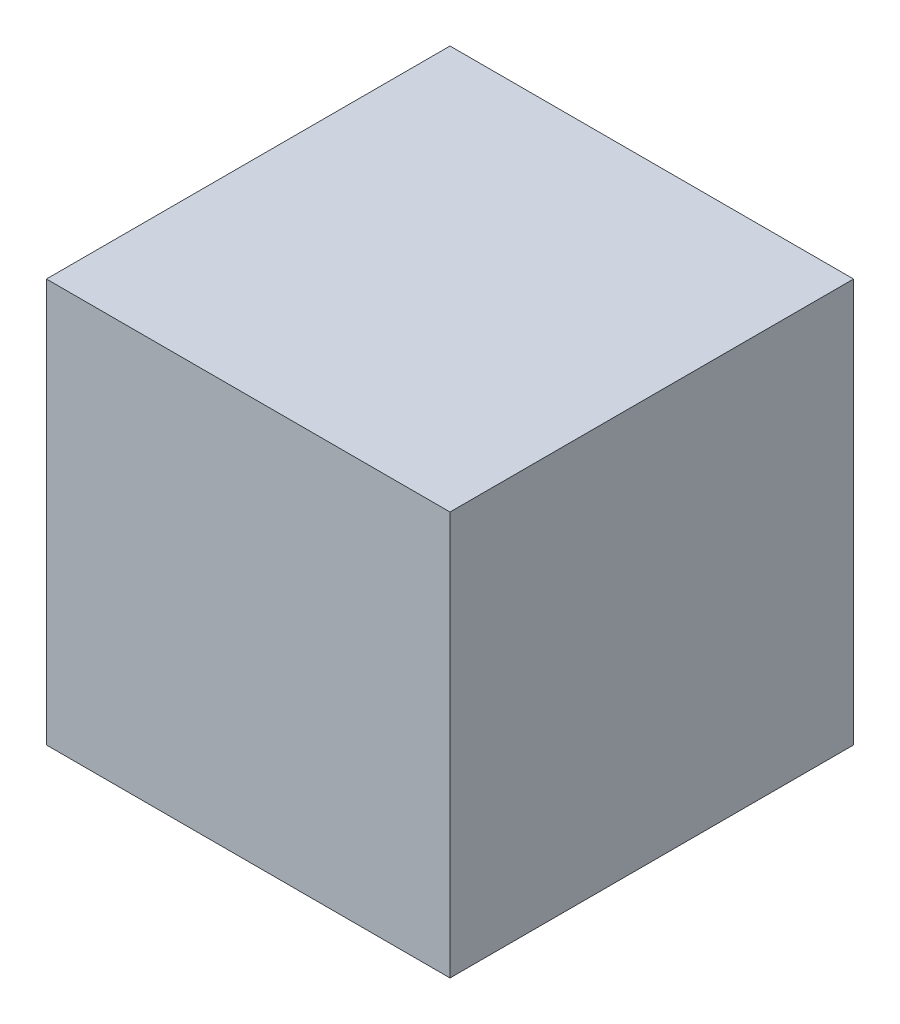
ISO-10303-21;
HEADER;
FILE_DESCRIPTION(('STEP AP214'),'2;1');
FILE_NAME('part.step','',(''),(''),'','','');
FILE_SCHEMA(('AUTOMOTIVE_DESIGN { 1 0 10303 214 1 1 1 1 }'));
ENDSEC;
DATA;
#1=APPLICATION_CONTEXT('core data for automotive mechanical design processes');
#2=APPLICATION_PROTOCOL_DEFINITION('international standard','automotive_design',2000,#1);
#3=PRODUCT_CONTEXT('',#1,'mechanical');
#4=PRODUCT('Part','Part','',(#3));
#5=PRODUCT_RELATED_PRODUCT_CATEGORY('part','',(#4));
#6=PRODUCT_DEFINITION_FORMATION('','',#4);
#7=PRODUCT_DEFINITION_CONTEXT('part definition',#1,'design');
#8=PRODUCT_DEFINITION('design','',#6,#7);
#9=PRODUCT_DEFINITION_SHAPE('','',#8);
#10=(LENGTH_UNIT() NAMED_UNIT(*) SI_UNIT(.MILLI.,.METRE.));
#11=(NAMED_UNIT(*) PLANE_ANGLE_UNIT() SI_UNIT($,.RADIAN.));
#12=(NAMED_UNIT(*) SI_UNIT($,.STERADIAN.) SOLID_ANGLE_UNIT());
#13=UNCERTAINTY_MEASURE_WITH_UNIT(LENGTH_MEASURE(1.E-05),#10,'distance_accuracy_value','');
#14=(GEOMETRIC_REPRESENTATION_CONTEXT(3) GLOBAL_UNCERTAINTY_ASSIGNED_CONTEXT((#13)) GLOBAL_UNIT_ASSIGNED_CONTEXT((#10,
#11,#12)) REPRESENTATION_CONTEXT('',''));
#15=CARTESIAN_POINT('',(0.,0.,0.));
#16=DIRECTION('',(0.,0.,1.));
#17=DIRECTION('',(1.,0.,0.));
#18=AXIS2_PLACEMENT_3D('',#15,#16,#17);
#19=CARTESIAN_POINT('',(0.,228.6,0.));
#20=DIRECTION('',(1.,0.,0.));
#21=DIRECTION('',(0.,0.,-1.));
#22=AXIS2_PLACEMENT_3D('',#19,#20,#21);
#23=PLANE('',#22);
#24=DIRECTION('',(0.,0.,1.));
#25=VECTOR('',#24,1.);
#26=CARTESIAN_POINT('',(0.,0.,0.));
#27=LINE('',#26,#25);
#28=CARTESIAN_POINT('',(0.,0.,-228.6));
#29=VERTEX_POINT('',#28);
#30=CARTESIAN_POINT('',(0.,0.,0.));
#31=VERTEX_POINT('',#30);
#32=EDGE_CURVE('E75',#29,#31,#27,.T.);
#33=ORIENTED_EDGE('',*,*,#32,.T.);
#34=DIRECTION('',(0.,-1.,0.));
#35=VECTOR('',#34,1.);
#36=CARTESIAN_POINT('',(0.,228.6,0.));
#37=LINE('',#36,#35);
#38=CARTESIAN_POINT('',(0.,228.6,0.));
#39=VERTEX_POINT('',#38);
#40=EDGE_CURVE('E11',#39,#31,#37,.T.);
#41=ORIENTED_EDGE('',*,*,#40,.F.);
#42=DIRECTION('',(0.,0.,1.));
#43=VECTOR('',#42,1.);
#44=CARTESIAN_POINT('',(0.,228.6,0.));
#45=LINE('',#44,#43);
#46=CARTESIAN_POINT('',(0.,228.6,-228.6));
#47=VERTEX_POINT('',#46);
#48=EDGE_CURVE('E93',#47,#39,#45,.T.);
#49=ORIENTED_EDGE('',*,*,#48,.F.);
#50=DIRECTION('',(0.,-1.,0.));
#51=VECTOR('',#50,1.);
#52=CARTESIAN_POINT('',(0.,228.6,-228.6));
#53=LINE('',#52,#51);
#54=EDGE_CURVE('E87',#47,#29,#53,.T.);
#55=ORIENTED_EDGE('',*,*,#54,.T.);
#56=EDGE_LOOP('',(#33,#41,#49,#55));
#57=FACE_BOUND('',#56,.T.);
#58=ADVANCED_FACE('F31',(#57),#23,.F.);
#59=CARTESIAN_POINT('',(0.,228.6,0.));
#60=DIRECTION('',(0.,0.,-1.));
#61=DIRECTION('',(-1.,0.,0.));
#62=AXIS2_PLACEMENT_3D('',#59,#60,#61);
#63=PLANE('',#62);
#64=DIRECTION('',(1.,0.,0.));
#65=VECTOR('',#64,1.);
#66=CARTESIAN_POINT('',(0.,0.,0.));
#67=LINE('',#66,#65);
#68=CARTESIAN_POINT('',(228.6,0.,0.));
#69=VERTEX_POINT('',#68);
#70=EDGE_CURVE('E71',#31,#69,#67,.T.);
#71=ORIENTED_EDGE('',*,*,#70,.T.);
#72=DIRECTION('',(0.,-1.,0.));
#73=VECTOR('',#72,1.);
#74=CARTESIAN_POINT('',(228.6,228.6,0.));
#75=LINE('',#74,#73);
#76=CARTESIAN_POINT('',(228.6,228.6,0.));
#77=VERTEX_POINT('',#76);
#78=EDGE_CURVE('E38',#77,#69,#75,.T.);
#79=ORIENTED_EDGE('',*,*,#78,.F.);
#80=DIRECTION('',(1.,0.,0.));
#81=VECTOR('',#80,1.);
#82=CARTESIAN_POINT('',(0.,228.6,0.));
#83=LINE('',#82,#81);
#84=EDGE_CURVE('E83',#39,#77,#83,.T.);
#85=ORIENTED_EDGE('',*,*,#84,.F.);
#86=ORIENTED_EDGE('',*,*,#40,.T.);
#87=EDGE_LOOP('',(#71,#79,#85,#86));
#88=FACE_BOUND('',#87,.T.);
#89=ADVANCED_FACE('F82',(#88),#63,.F.);
#90=CARTESIAN_POINT('',(228.6,228.6,0.));
#91=DIRECTION('',(-1.,0.,0.));
#92=DIRECTION('',(0.,0.,1.));
#93=AXIS2_PLACEMENT_3D('',#90,#91,#92);
#94=PLANE('',#93);
#95=DIRECTION('',(0.,0.,-1.));
#96=VECTOR('',#95,1.);
#97=CARTESIAN_POINT('',(228.6,0.,0.));
#98=LINE('',#97,#96);
#99=CARTESIAN_POINT('',(228.6,0.,-228.6));
#100=VERTEX_POINT('',#99);
#101=EDGE_CURVE('E76',#69,#100,#98,.T.);
#102=ORIENTED_EDGE('',*,*,#101,.T.);
#103=DIRECTION('',(0.,-1.,0.));
#104=VECTOR('',#103,1.);
#105=CARTESIAN_POINT('',(228.6,228.6,-228.6));
#106=LINE('',#105,#104);
#107=CARTESIAN_POINT('',(228.6,228.6,-228.6));
#108=VERTEX_POINT('',#107);
#109=EDGE_CURVE('E99',#108,#100,#106,.T.);
#110=ORIENTED_EDGE('',*,*,#109,.F.);
#111=DIRECTION('',(0.,0.,-1.));
#112=VECTOR('',#111,1.);
#113=CARTESIAN_POINT('',(228.6,228.6,0.));
#114=LINE('',#113,#112);
#115=EDGE_CURVE('E50',#77,#108,#114,.T.);
#116=ORIENTED_EDGE('',*,*,#115,.F.);
#117=ORIENTED_EDGE('',*,*,#78,.T.);
#118=EDGE_LOOP('',(#102,#110,#116,#117));
#119=FACE_BOUND('',#118,.T.);
#120=ADVANCED_FACE('F102',(#119),#94,.F.);
#121=CARTESIAN_POINT('',(0.,228.6,-228.6));
#122=DIRECTION('',(0.,0.,1.));
#123=DIRECTION('',(1.,0.,0.));
#124=AXIS2_PLACEMENT_3D('',#121,#122,#123);
#125=PLANE('',#124);
#126=DIRECTION('',(-1.,0.,0.));
#127=VECTOR('',#126,1.);
#128=CARTESIAN_POINT('',(0.,0.,-228.6));
#129=LINE('',#128,#127);
#130=EDGE_CURVE('E91',#100,#29,#129,.T.);
#131=ORIENTED_EDGE('',*,*,#130,.T.);
#132=ORIENTED_EDGE('',*,*,#54,.F.);
#133=DIRECTION('',(-1.,0.,0.));
#134=VECTOR('',#133,1.);
#135=CARTESIAN_POINT('',(0.,228.6,-228.6));
#136=LINE('',#135,#134);
#137=EDGE_CURVE('E45',#108,#47,#136,.T.);
#138=ORIENTED_EDGE('',*,*,#137,.F.);
#139=ORIENTED_EDGE('',*,*,#109,.T.);
#140=EDGE_LOOP('',(#131,#132,#138,#139));
#141=FACE_BOUND('',#140,.T.);
#142=ADVANCED_FACE('F104',(#141),#125,.F.);
#143=CARTESIAN_POINT('',(0.,228.6,-228.6));
#144=DIRECTION('',(0.,-1.,0.));
#145=DIRECTION('',(0.,0.,-1.));
#146=AXIS2_PLACEMENT_3D('',#143,#144,#145);
#147=PLANE('',#146);
#148=ORIENTED_EDGE('',*,*,#48,.T.);
#149=ORIENTED_EDGE('',*,*,#84,.T.);
#150=ORIENTED_EDGE('',*,*,#115,.T.);
#151=ORIENTED_EDGE('',*,*,#137,.T.);
#152=EDGE_LOOP('',(#148,#149,#150,#151));
#153=FACE_BOUND('',#152,.T.);
#154=ADVANCED_FACE('F105',(#153),#147,.F.);
#155=CARTESIAN_POINT('',(0.,0.,-228.6));
#156=DIRECTION('',(0.,-1.,0.));
#157=DIRECTION('',(0.,0.,-1.));
#158=AXIS2_PLACEMENT_3D('',#155,#156,#157);
#159=PLANE('',#158);
#160=ORIENTED_EDGE('',*,*,#32,.F.);
#161=ORIENTED_EDGE('',*,*,#130,.F.);
#162=ORIENTED_EDGE('',*,*,#101,.F.);
#163=ORIENTED_EDGE('',*,*,#70,.F.);
#164=EDGE_LOOP('',(#160,#161,#162,#163));
#165=FACE_BOUND('',#164,.T.);
#166=ADVANCED_FACE('F72',(#165),#159,.T.);
#167=CLOSED_SHELL('',(#58,#89,#120,#142,#154,#166));
#168=MANIFOLD_SOLID_BREP('B2',#167);
#169=ADVANCED_BREP_SHAPE_REPRESENTATION('',(#18,#168),#14);
#170=SHAPE_DEFINITION_REPRESENTATION(#9,#169);
ENDSEC;
END-ISO-10303-21;
